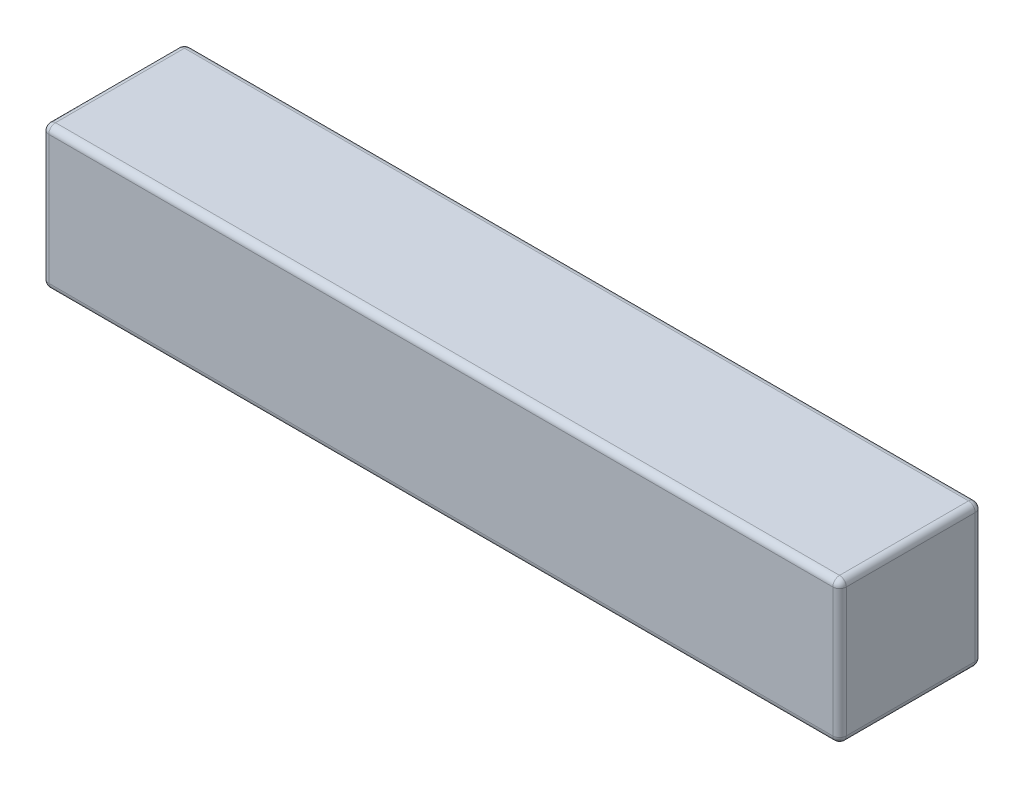
ISO-10303-21;
HEADER;
FILE_DESCRIPTION(('STEP AP214'),'2;1');
FILE_NAME('part.step','',(''),(''),'','','');
FILE_SCHEMA(('AUTOMOTIVE_DESIGN { 1 0 10303 214 1 1 1 1 }'));
ENDSEC;
DATA;
#1=APPLICATION_CONTEXT('core data for automotive mechanical design processes');
#2=APPLICATION_PROTOCOL_DEFINITION('international standard','automotive_design',2000,#1);
#3=PRODUCT_CONTEXT('',#1,'mechanical');
#4=PRODUCT('Part','Part','',(#3));
#5=PRODUCT_RELATED_PRODUCT_CATEGORY('part','',(#4));
#6=PRODUCT_DEFINITION_FORMATION('','',#4);
#7=PRODUCT_DEFINITION_CONTEXT('part definition',#1,'design');
#8=PRODUCT_DEFINITION('design','',#6,#7);
#9=PRODUCT_DEFINITION_SHAPE('','',#8);
#10=(LENGTH_UNIT() NAMED_UNIT(*) SI_UNIT(.MILLI.,.METRE.));
#11=(NAMED_UNIT(*) PLANE_ANGLE_UNIT() SI_UNIT($,.RADIAN.));
#12=(NAMED_UNIT(*) SI_UNIT($,.STERADIAN.) SOLID_ANGLE_UNIT());
#13=UNCERTAINTY_MEASURE_WITH_UNIT(LENGTH_MEASURE(1.E-05),#10,'distance_accuracy_value','');
#14=(GEOMETRIC_REPRESENTATION_CONTEXT(3) GLOBAL_UNCERTAINTY_ASSIGNED_CONTEXT((#13)) GLOBAL_UNIT_ASSIGNED_CONTEXT((#10,
#11,#12)) REPRESENTATION_CONTEXT('',''));
#15=CARTESIAN_POINT('',(0.,0.,0.));
#16=DIRECTION('',(0.,0.,1.));
#17=DIRECTION('',(1.,0.,0.));
#18=AXIS2_PLACEMENT_3D('',#15,#16,#17);
#19=CARTESIAN_POINT('',(13.85,-0.15,-0.379239631336402));
#20=DIRECTION('',(1.,0.,0.));
#21=DIRECTION('',(0.,0.,-1.));
#22=AXIS2_PLACEMENT_3D('',#19,#20,#21);
#23=SPHERICAL_SURFACE('',#22,0.15);
#24=CARTESIAN_POINT('',(13.85,-0.15,-0.379239631336402));
#25=DIRECTION('',(0.,1.,0.));
#26=DIRECTION('',(0.,0.,1.));
#27=AXIS2_PLACEMENT_3D('',#24,#25,#26);
#28=CIRCLE('',#27,0.15);
#29=CARTESIAN_POINT('',(14.,-0.15,-0.379239631336402));
#30=VERTEX_POINT('',#29);
#31=CARTESIAN_POINT('',(13.85,-0.15,-0.229239631336402));
#32=VERTEX_POINT('',#31);
#33=EDGE_CURVE('E293',#30,#32,#28,.F.);
#34=ORIENTED_EDGE('',*,*,#33,.F.);
#35=CARTESIAN_POINT('',(13.85,-0.15,-0.379239631336402));
#36=DIRECTION('',(0.,0.,-1.));
#37=DIRECTION('',(-1.,0.,0.));
#38=AXIS2_PLACEMENT_3D('',#35,#36,#37);
#39=CIRCLE('',#38,0.150000000000001);
#40=CARTESIAN_POINT('',(13.85,0.,-0.379239631336402));
#41=VERTEX_POINT('',#40);
#42=EDGE_CURVE('E114',#41,#30,#39,.T.);
#43=ORIENTED_EDGE('',*,*,#42,.F.);
#44=CARTESIAN_POINT('',(13.85,-0.15,-0.379239631336402));
#45=DIRECTION('',(1.,0.,0.));
#46=DIRECTION('',(0.,0.,-1.));
#47=AXIS2_PLACEMENT_3D('',#44,#45,#46);
#48=CIRCLE('',#47,0.15);
#49=EDGE_CURVE('E103',#32,#41,#48,.F.);
#50=ORIENTED_EDGE('',*,*,#49,.F.);
#51=EDGE_LOOP('',(#34,#43,#50));
#52=FACE_BOUND('',#51,.T.);
#53=ADVANCED_FACE('F16',(#52),#23,.T.);
#54=CARTESIAN_POINT('',(13.85,-0.15,-3.2542396313364));
#55=DIRECTION('',(1.,0.,0.));
#56=DIRECTION('',(0.,0.,-1.));
#57=AXIS2_PLACEMENT_3D('',#54,#55,#56);
#58=SPHERICAL_SURFACE('',#57,0.15);
#59=CARTESIAN_POINT('',(13.85,-0.15,-3.2542396313364));
#60=DIRECTION('',(0.,1.,0.));
#61=DIRECTION('',(0.,0.,1.));
#62=AXIS2_PLACEMENT_3D('',#59,#60,#61);
#63=CIRCLE('',#62,0.15);
#64=CARTESIAN_POINT('',(13.85,-0.15,-3.4042396313364));
#65=VERTEX_POINT('',#64);
#66=CARTESIAN_POINT('',(14.,-0.15,-3.2542396313364));
#67=VERTEX_POINT('',#66);
#68=EDGE_CURVE('E135',#65,#67,#63,.F.);
#69=ORIENTED_EDGE('',*,*,#68,.F.);
#70=CARTESIAN_POINT('',(13.85,-0.15,-3.2542396313364));
#71=DIRECTION('',(-1.,0.,0.));
#72=DIRECTION('',(0.,0.,1.));
#73=AXIS2_PLACEMENT_3D('',#70,#71,#72);
#74=CIRCLE('',#73,0.15);
#75=CARTESIAN_POINT('',(13.85,0.,-3.2542396313364));
#76=VERTEX_POINT('',#75);
#77=EDGE_CURVE('E288',#76,#65,#74,.T.);
#78=ORIENTED_EDGE('',*,*,#77,.F.);
#79=CARTESIAN_POINT('',(13.85,-0.15,-3.2542396313364));
#80=DIRECTION('',(0.,0.,-1.));
#81=DIRECTION('',(-1.,0.,0.));
#82=AXIS2_PLACEMENT_3D('',#79,#80,#81);
#83=CIRCLE('',#82,0.150000000000001);
#84=EDGE_CURVE('E284',#67,#76,#83,.F.);
#85=ORIENTED_EDGE('',*,*,#84,.F.);
#86=EDGE_LOOP('',(#69,#78,#85));
#87=FACE_BOUND('',#86,.T.);
#88=ADVANCED_FACE('F156',(#87),#58,.T.);
#89=CARTESIAN_POINT('',(-3.78,0.,-0.229239631336402));
#90=DIRECTION('',(0.,1.,0.));
#91=DIRECTION('',(0.,0.,1.));
#92=AXIS2_PLACEMENT_3D('',#89,#90,#91);
#93=PLANE('',#92);
#94=DIRECTION('',(0.,0.,1.));
#95=VECTOR('',#94,1.);
#96=CARTESIAN_POINT('',(-3.63,0.,-0.229239631336402));
#97=LINE('',#96,#95);
#98=CARTESIAN_POINT('',(-3.63,0.,-0.379239631336402));
#99=VERTEX_POINT('',#98);
#100=CARTESIAN_POINT('',(-3.63,0.,-3.2542396313364));
#101=VERTEX_POINT('',#100);
#102=EDGE_CURVE('E118',#99,#101,#97,.F.);
#103=ORIENTED_EDGE('',*,*,#102,.F.);
#104=DIRECTION('',(1.,0.,0.));
#105=VECTOR('',#104,1.);
#106=CARTESIAN_POINT('',(-3.78,0.,-0.379239631336402));
#107=LINE('',#106,#105);
#108=EDGE_CURVE('E106',#41,#99,#107,.F.);
#109=ORIENTED_EDGE('',*,*,#108,.F.);
#110=DIRECTION('',(0.,0.,-1.));
#111=VECTOR('',#110,1.);
#112=CARTESIAN_POINT('',(13.85,0.,-0.229239631336402));
#113=LINE('',#112,#111);
#114=EDGE_CURVE('E286',#76,#41,#113,.F.);
#115=ORIENTED_EDGE('',*,*,#114,.F.);
#116=DIRECTION('',(-1.,0.,0.));
#117=VECTOR('',#116,1.);
#118=CARTESIAN_POINT('',(-3.78,0.,-3.2542396313364));
#119=LINE('',#118,#117);
#120=EDGE_CURVE('E122',#101,#76,#119,.F.);
#121=ORIENTED_EDGE('',*,*,#120,.F.);
#122=EDGE_LOOP('',(#103,#109,#115,#121));
#123=FACE_BOUND('',#122,.T.);
#124=ADVANCED_FACE('F120',(#123),#93,.T.);
#125=CARTESIAN_POINT('',(-3.63,-0.15,-3.2542396313364));
#126=DIRECTION('',(1.,0.,0.));
#127=DIRECTION('',(0.,0.,-1.));
#128=AXIS2_PLACEMENT_3D('',#125,#126,#127);
#129=SPHERICAL_SURFACE('',#128,0.15);
#130=CARTESIAN_POINT('',(-3.63,-0.15,-3.2542396313364));
#131=DIRECTION('',(0.,0.,1.));
#132=DIRECTION('',(1.,0.,0.));
#133=AXIS2_PLACEMENT_3D('',#130,#131,#132);
#134=CIRCLE('',#133,0.15);
#135=CARTESIAN_POINT('',(-3.78,-0.15,-3.2542396313364));
#136=VERTEX_POINT('',#135);
#137=EDGE_CURVE('E124',#101,#136,#134,.T.);
#138=ORIENTED_EDGE('',*,*,#137,.F.);
#139=CARTESIAN_POINT('',(-3.63,-0.15,-3.2542396313364));
#140=DIRECTION('',(-1.,0.,0.));
#141=DIRECTION('',(0.,0.,1.));
#142=AXIS2_PLACEMENT_3D('',#139,#140,#141);
#143=CIRCLE('',#142,0.15);
#144=CARTESIAN_POINT('',(-3.63,-0.15,-3.4042396313364));
#145=VERTEX_POINT('',#144);
#146=EDGE_CURVE('E292',#145,#101,#143,.F.);
#147=ORIENTED_EDGE('',*,*,#146,.F.);
#148=CARTESIAN_POINT('',(-3.63,-0.15,-3.2542396313364));
#149=DIRECTION('',(0.,1.,0.));
#150=DIRECTION('',(0.,0.,1.));
#151=AXIS2_PLACEMENT_3D('',#148,#149,#150);
#152=CIRCLE('',#151,0.15);
#153=EDGE_CURVE('E365',#136,#145,#152,.F.);
#154=ORIENTED_EDGE('',*,*,#153,.F.);
#155=EDGE_LOOP('',(#138,#147,#154));
#156=FACE_BOUND('',#155,.T.);
#157=ADVANCED_FACE('F150',(#156),#129,.T.);
#158=CARTESIAN_POINT('',(-3.63,-0.15,-0.379239631336402));
#159=DIRECTION('',(1.,0.,0.));
#160=DIRECTION('',(0.,0.,-1.));
#161=AXIS2_PLACEMENT_3D('',#158,#159,#160);
#162=SPHERICAL_SURFACE('',#161,0.15);
#163=CARTESIAN_POINT('',(-3.63,-0.15,-0.379239631336402));
#164=DIRECTION('',(1.,0.,0.));
#165=DIRECTION('',(0.,0.,-1.));
#166=AXIS2_PLACEMENT_3D('',#163,#164,#165);
#167=CIRCLE('',#166,0.15);
#168=CARTESIAN_POINT('',(-3.63,-0.15,-0.229239631336402));
#169=VERTEX_POINT('',#168);
#170=EDGE_CURVE('E110',#99,#169,#167,.T.);
#171=ORIENTED_EDGE('',*,*,#170,.F.);
#172=CARTESIAN_POINT('',(-3.63,-0.15,-0.379239631336402));
#173=DIRECTION('',(0.,0.,1.));
#174=DIRECTION('',(1.,0.,0.));
#175=AXIS2_PLACEMENT_3D('',#172,#173,#174);
#176=CIRCLE('',#175,0.15);
#177=CARTESIAN_POINT('',(-3.78,-0.15,-0.379239631336402));
#178=VERTEX_POINT('',#177);
#179=EDGE_CURVE('E125',#178,#99,#176,.F.);
#180=ORIENTED_EDGE('',*,*,#179,.F.);
#181=CARTESIAN_POINT('',(-3.63,-0.15,-0.379239631336402));
#182=DIRECTION('',(0.,1.,0.));
#183=DIRECTION('',(0.,0.,1.));
#184=AXIS2_PLACEMENT_3D('',#181,#182,#183);
#185=CIRCLE('',#184,0.15);
#186=EDGE_CURVE('E138',#169,#178,#185,.F.);
#187=ORIENTED_EDGE('',*,*,#186,.F.);
#188=EDGE_LOOP('',(#171,#180,#187));
#189=FACE_BOUND('',#188,.T.);
#190=ADVANCED_FACE('F137',(#189),#162,.T.);
#191=CARTESIAN_POINT('',(-3.78,-0.15,-0.379239631336402));
#192=DIRECTION('',(1.,0.,0.));
#193=DIRECTION('',(0.,0.,-1.));
#194=AXIS2_PLACEMENT_3D('',#191,#192,#193);
#195=CYLINDRICAL_SURFACE('',#194,0.15);
#196=ORIENTED_EDGE('',*,*,#49,.T.);
#197=ORIENTED_EDGE('',*,*,#108,.T.);
#198=ORIENTED_EDGE('',*,*,#170,.T.);
#199=DIRECTION('',(1.,0.,0.));
#200=VECTOR('',#199,1.);
#201=CARTESIAN_POINT('',(-3.78,-0.15,-0.229239631336402));
#202=LINE('',#201,#200);
#203=EDGE_CURVE('E378',#32,#169,#202,.F.);
#204=ORIENTED_EDGE('',*,*,#203,.F.);
#205=EDGE_LOOP('',(#196,#197,#198,#204));
#206=FACE_BOUND('',#205,.T.);
#207=ADVANCED_FACE('F108',(#206),#195,.T.);
#208=CARTESIAN_POINT('',(13.85,-0.15,-0.229239631336402));
#209=DIRECTION('',(0.,0.,-1.));
#210=DIRECTION('',(-1.,0.,0.));
#211=AXIS2_PLACEMENT_3D('',#208,#209,#210);
#212=CYLINDRICAL_SURFACE('',#211,0.150000000000001);
#213=ORIENTED_EDGE('',*,*,#84,.T.);
#214=ORIENTED_EDGE('',*,*,#114,.T.);
#215=ORIENTED_EDGE('',*,*,#42,.T.);
#216=DIRECTION('',(0.,0.,-1.));
#217=VECTOR('',#216,1.);
#218=CARTESIAN_POINT('',(14.,-0.15,-0.229239631336402));
#219=LINE('',#218,#217);
#220=EDGE_CURVE('E236',#67,#30,#219,.F.);
#221=ORIENTED_EDGE('',*,*,#220,.F.);
#222=EDGE_LOOP('',(#213,#214,#215,#221));
#223=FACE_BOUND('',#222,.T.);
#224=ADVANCED_FACE('F274',(#223),#212,.T.);
#225=CARTESIAN_POINT('',(13.85,-3.175,-0.379239631336402));
#226=DIRECTION('',(0.,1.,0.));
#227=DIRECTION('',(0.,0.,1.));
#228=AXIS2_PLACEMENT_3D('',#225,#226,#227);
#229=CYLINDRICAL_SURFACE('',#228,0.15);
#230=ORIENTED_EDGE('',*,*,#33,.T.);
#231=DIRECTION('',(0.,1.,0.));
#232=VECTOR('',#231,1.);
#233=CARTESIAN_POINT('',(13.85,-3.175,-0.229239631336402));
#234=LINE('',#233,#232);
#235=CARTESIAN_POINT('',(13.85,-3.02499999999923,-0.229239631336402));
#236=VERTEX_POINT('',#235);
#237=EDGE_CURVE('E310',#236,#32,#234,.T.);
#238=ORIENTED_EDGE('',*,*,#237,.F.);
#239=CARTESIAN_POINT('',(13.85,-3.025,-0.379239631336402));
#240=DIRECTION('',(0.,-1.,2.04433251509177E-11));
#241=DIRECTION('',(1.,0.,0.));
#242=AXIS2_PLACEMENT_3D('',#239,#240,#241);
#243=CIRCLE('',#242,0.15);
#244=CARTESIAN_POINT('',(14.,-3.025,-0.379239631336402));
#245=VERTEX_POINT('',#244);
#246=EDGE_CURVE('E242',#245,#236,#243,.T.);
#247=ORIENTED_EDGE('',*,*,#246,.F.);
#248=DIRECTION('',(0.,1.,0.));
#249=VECTOR('',#248,1.);
#250=CARTESIAN_POINT('',(14.,-3.175,-0.379239631336402));
#251=LINE('',#250,#249);
#252=EDGE_CURVE('E234',#30,#245,#251,.F.);
#253=ORIENTED_EDGE('',*,*,#252,.F.);
#254=EDGE_LOOP('',(#230,#238,#247,#253));
#255=FACE_BOUND('',#254,.T.);
#256=ADVANCED_FACE('F271',(#255),#229,.T.);
#257=CARTESIAN_POINT('',(-3.78,-0.15,-3.2542396313364));
#258=DIRECTION('',(-1.,0.,0.));
#259=DIRECTION('',(0.,0.,1.));
#260=AXIS2_PLACEMENT_3D('',#257,#258,#259);
#261=CYLINDRICAL_SURFACE('',#260,0.15);
#262=ORIENTED_EDGE('',*,*,#146,.T.);
#263=ORIENTED_EDGE('',*,*,#120,.T.);
#264=ORIENTED_EDGE('',*,*,#77,.T.);
#265=DIRECTION('',(-1.,0.,0.));
#266=VECTOR('',#265,1.);
#267=CARTESIAN_POINT('',(14.,-0.15,-3.4042396313364));
#268=LINE('',#267,#266);
#269=EDGE_CURVE('E375',#145,#65,#268,.F.);
#270=ORIENTED_EDGE('',*,*,#269,.F.);
#271=EDGE_LOOP('',(#262,#263,#264,#270));
#272=FACE_BOUND('',#271,.T.);
#273=ADVANCED_FACE('F267',(#272),#261,.T.);
#274=CARTESIAN_POINT('',(13.85,-3.175,-3.2542396313364));
#275=DIRECTION('',(0.,1.,0.));
#276=DIRECTION('',(0.,0.,1.));
#277=AXIS2_PLACEMENT_3D('',#274,#275,#276);
#278=CYLINDRICAL_SURFACE('',#277,0.15);
#279=ORIENTED_EDGE('',*,*,#68,.T.);
#280=DIRECTION('',(0.,1.,0.));
#281=VECTOR('',#280,1.);
#282=CARTESIAN_POINT('',(14.,-3.175,-3.2542396313364));
#283=LINE('',#282,#281);
#284=CARTESIAN_POINT('',(14.,-3.025,-3.2542396313364));
#285=VERTEX_POINT('',#284);
#286=EDGE_CURVE('E239',#285,#67,#283,.T.);
#287=ORIENTED_EDGE('',*,*,#286,.F.);
#288=CARTESIAN_POINT('',(13.85,-3.025,-3.2542396313364));
#289=DIRECTION('',(0.,1.,0.));
#290=DIRECTION('',(1.,0.,0.));
#291=AXIS2_PLACEMENT_3D('',#288,#289,#290);
#292=CIRCLE('',#291,0.15);
#293=CARTESIAN_POINT('',(13.85,-3.025,-3.4042396313364));
#294=VERTEX_POINT('',#293);
#295=EDGE_CURVE('E232',#294,#285,#292,.F.);
#296=ORIENTED_EDGE('',*,*,#295,.F.);
#297=DIRECTION('',(0.,1.,0.));
#298=VECTOR('',#297,1.);
#299=CARTESIAN_POINT('',(13.85,-3.175,-3.4042396313364));
#300=LINE('',#299,#298);
#301=EDGE_CURVE('E374',#65,#294,#300,.F.);
#302=ORIENTED_EDGE('',*,*,#301,.F.);
#303=EDGE_LOOP('',(#279,#287,#296,#302));
#304=FACE_BOUND('',#303,.T.);
#305=ADVANCED_FACE('F264',(#304),#278,.T.);
#306=CARTESIAN_POINT('',(-3.63,-0.15,-0.229239631336402));
#307=DIRECTION('',(0.,0.,1.));
#308=DIRECTION('',(1.,0.,0.));
#309=AXIS2_PLACEMENT_3D('',#306,#307,#308);
#310=CYLINDRICAL_SURFACE('',#309,0.15);
#311=ORIENTED_EDGE('',*,*,#137,.T.);
#312=DIRECTION('',(0.,0.,1.));
#313=VECTOR('',#312,1.);
#314=CARTESIAN_POINT('',(-3.78,-0.15,-3.4042396313364));
#315=LINE('',#314,#313);
#316=EDGE_CURVE('E131',#178,#136,#315,.F.);
#317=ORIENTED_EDGE('',*,*,#316,.F.);
#318=ORIENTED_EDGE('',*,*,#179,.T.);
#319=ORIENTED_EDGE('',*,*,#102,.T.);
#320=EDGE_LOOP('',(#311,#317,#318,#319));
#321=FACE_BOUND('',#320,.T.);
#322=ADVANCED_FACE('F129',(#321),#310,.T.);
#323=CARTESIAN_POINT('',(-3.63,-3.175,-3.2542396313364));
#324=DIRECTION('',(0.,1.,0.));
#325=DIRECTION('',(0.,0.,1.));
#326=AXIS2_PLACEMENT_3D('',#323,#324,#325);
#327=CYLINDRICAL_SURFACE('',#326,0.15);
#328=ORIENTED_EDGE('',*,*,#153,.T.);
#329=DIRECTION('',(0.,1.,0.));
#330=VECTOR('',#329,1.);
#331=CARTESIAN_POINT('',(-3.63,-3.175,-3.4042396313364));
#332=LINE('',#331,#330);
#333=CARTESIAN_POINT('',(-3.63,-3.025,-3.4042396313364));
#334=VERTEX_POINT('',#333);
#335=EDGE_CURVE('E230',#334,#145,#332,.T.);
#336=ORIENTED_EDGE('',*,*,#335,.F.);
#337=CARTESIAN_POINT('',(-3.63,-3.025,-3.2542396313364));
#338=DIRECTION('',(0.,1.,0.));
#339=DIRECTION('',(0.,0.,1.));
#340=AXIS2_PLACEMENT_3D('',#337,#338,#339);
#341=CIRCLE('',#340,0.15);
#342=CARTESIAN_POINT('',(-3.78,-3.025,-3.2542396313364));
#343=VERTEX_POINT('',#342);
#344=EDGE_CURVE('E367',#334,#343,#341,.T.);
#345=ORIENTED_EDGE('',*,*,#344,.T.);
#346=DIRECTION('',(0.,1.,0.));
#347=VECTOR('',#346,1.);
#348=CARTESIAN_POINT('',(-3.78,-3.175,-3.2542396313364));
#349=LINE('',#348,#347);
#350=EDGE_CURVE('E204',#136,#343,#349,.F.);
#351=ORIENTED_EDGE('',*,*,#350,.F.);
#352=EDGE_LOOP('',(#328,#336,#345,#351));
#353=FACE_BOUND('',#352,.T.);
#354=ADVANCED_FACE('F257',(#353),#327,.T.);
#355=CARTESIAN_POINT('',(-3.63,-3.175,-0.379239631336402));
#356=DIRECTION('',(0.,1.,0.));
#357=DIRECTION('',(0.,0.,1.));
#358=AXIS2_PLACEMENT_3D('',#355,#356,#357);
#359=CYLINDRICAL_SURFACE('',#358,0.15);
#360=ORIENTED_EDGE('',*,*,#186,.T.);
#361=DIRECTION('',(0.,1.,0.));
#362=VECTOR('',#361,1.);
#363=CARTESIAN_POINT('',(-3.78,-3.175,-0.379239631336402));
#364=LINE('',#363,#362);
#365=CARTESIAN_POINT('',(-3.78,-3.025,-0.379239631336402));
#366=VERTEX_POINT('',#365);
#367=EDGE_CURVE('E202',#366,#178,#364,.T.);
#368=ORIENTED_EDGE('',*,*,#367,.F.);
#369=CARTESIAN_POINT('',(-3.63,-3.025,-0.379239631336402));
#370=DIRECTION('',(0.,-1.,0.));
#371=DIRECTION('',(1.,0.,0.));
#372=AXIS2_PLACEMENT_3D('',#369,#370,#371);
#373=CIRCLE('',#372,0.15);
#374=CARTESIAN_POINT('',(-3.63,-3.025,-0.229239631336402));
#375=VERTEX_POINT('',#374);
#376=EDGE_CURVE('E208',#375,#366,#373,.T.);
#377=ORIENTED_EDGE('',*,*,#376,.F.);
#378=DIRECTION('',(0.,1.,0.));
#379=VECTOR('',#378,1.);
#380=CARTESIAN_POINT('',(-3.63,-3.175,-0.229239631336402));
#381=LINE('',#380,#379);
#382=EDGE_CURVE('E315',#169,#375,#381,.F.);
#383=ORIENTED_EDGE('',*,*,#382,.F.);
#384=EDGE_LOOP('',(#360,#368,#377,#383));
#385=FACE_BOUND('',#384,.T.);
#386=ADVANCED_FACE('F253',(#385),#359,.T.);
#387=CARTESIAN_POINT('',(-3.78,-3.175,-0.229239631336402));
#388=DIRECTION('',(0.,0.,1.));
#389=DIRECTION('',(1.,0.,0.));
#390=AXIS2_PLACEMENT_3D('',#387,#388,#389);
#391=PLANE('',#390);
#392=ORIENTED_EDGE('',*,*,#382,.T.);
#393=DIRECTION('',(-1.,0.,0.));
#394=VECTOR('',#393,1.);
#395=CARTESIAN_POINT('',(-3.78,-3.025,-0.229239631336402));
#396=LINE('',#395,#394);
#397=EDGE_CURVE('E328',#236,#375,#396,.T.);
#398=ORIENTED_EDGE('',*,*,#397,.F.);
#399=ORIENTED_EDGE('',*,*,#237,.T.);
#400=ORIENTED_EDGE('',*,*,#203,.T.);
#401=EDGE_LOOP('',(#392,#398,#399,#400));
#402=FACE_BOUND('',#401,.T.);
#403=ADVANCED_FACE('F249',(#402),#391,.T.);
#404=CARTESIAN_POINT('',(13.85,-3.025,-0.379239631336402));
#405=DIRECTION('',(1.,0.,0.));
#406=DIRECTION('',(0.,0.,-1.));
#407=AXIS2_PLACEMENT_3D('',#404,#405,#406);
#408=SPHERICAL_SURFACE('',#407,0.15);
#409=CARTESIAN_POINT('',(13.85,-3.025,-0.379239631336402));
#410=DIRECTION('',(-1.,0.,0.));
#411=DIRECTION('',(0.,0.,1.));
#412=AXIS2_PLACEMENT_3D('',#409,#410,#411);
#413=CIRCLE('',#412,0.15);
#414=CARTESIAN_POINT('',(13.85,-3.175,-0.379239631336402));
#415=VERTEX_POINT('',#414);
#416=EDGE_CURVE('E200',#415,#236,#413,.T.);
#417=ORIENTED_EDGE('',*,*,#416,.F.);
#418=CARTESIAN_POINT('',(13.85,-3.025,-0.379239631336402));
#419=DIRECTION('',(0.,0.,1.));
#420=DIRECTION('',(1.,0.,0.));
#421=AXIS2_PLACEMENT_3D('',#418,#419,#420);
#422=CIRCLE('',#421,0.150000000000001);
#423=EDGE_CURVE('E319',#245,#415,#422,.F.);
#424=ORIENTED_EDGE('',*,*,#423,.F.);
#425=ORIENTED_EDGE('',*,*,#246,.T.);
#426=EDGE_LOOP('',(#417,#424,#425));
#427=FACE_BOUND('',#426,.T.);
#428=ADVANCED_FACE('F246',(#427),#408,.T.);
#429=CARTESIAN_POINT('',(14.,-3.175,-0.229239631336402));
#430=DIRECTION('',(1.,0.,0.));
#431=DIRECTION('',(0.,0.,-1.));
#432=AXIS2_PLACEMENT_3D('',#429,#430,#431);
#433=PLANE('',#432);
#434=ORIENTED_EDGE('',*,*,#220,.T.);
#435=ORIENTED_EDGE('',*,*,#252,.T.);
#436=DIRECTION('',(0.,0.,1.));
#437=VECTOR('',#436,1.);
#438=CARTESIAN_POINT('',(14.,-3.025,-0.229239631336402));
#439=LINE('',#438,#437);
#440=EDGE_CURVE('E317',#285,#245,#439,.T.);
#441=ORIENTED_EDGE('',*,*,#440,.F.);
#442=ORIENTED_EDGE('',*,*,#286,.T.);
#443=EDGE_LOOP('',(#434,#435,#441,#442));
#444=FACE_BOUND('',#443,.T.);
#445=ADVANCED_FACE('F224',(#444),#433,.T.);
#446=CARTESIAN_POINT('',(13.85,-3.025,-3.2542396313364));
#447=DIRECTION('',(1.,0.,0.));
#448=DIRECTION('',(0.,0.,-1.));
#449=AXIS2_PLACEMENT_3D('',#446,#447,#448);
#450=SPHERICAL_SURFACE('',#449,0.15);
#451=CARTESIAN_POINT('',(13.85,-3.025,-3.2542396313364));
#452=DIRECTION('',(1.,0.,0.));
#453=DIRECTION('',(0.,0.,-1.));
#454=AXIS2_PLACEMENT_3D('',#451,#452,#453);
#455=CIRCLE('',#454,0.15);
#456=CARTESIAN_POINT('',(13.85,-3.175,-3.25423963133334));
#457=VERTEX_POINT('',#456);
#458=EDGE_CURVE('E322',#294,#457,#455,.F.);
#459=ORIENTED_EDGE('',*,*,#458,.F.);
#460=ORIENTED_EDGE('',*,*,#295,.T.);
#461=CARTESIAN_POINT('',(13.85,-3.025,-3.2542396313364));
#462=DIRECTION('',(0.,0.,1.));
#463=DIRECTION('',(1.,0.,0.));
#464=AXIS2_PLACEMENT_3D('',#461,#462,#463);
#465=CIRCLE('',#464,0.150000000000001);
#466=EDGE_CURVE('E321',#457,#285,#465,.T.);
#467=ORIENTED_EDGE('',*,*,#466,.F.);
#468=EDGE_LOOP('',(#459,#460,#467));
#469=FACE_BOUND('',#468,.T.);
#470=ADVANCED_FACE('F219',(#469),#450,.T.);
#471=CARTESIAN_POINT('',(14.,-3.175,-3.4042396313364));
#472=DIRECTION('',(0.,0.,-1.));
#473=DIRECTION('',(-1.,0.,0.));
#474=AXIS2_PLACEMENT_3D('',#471,#472,#473);
#475=PLANE('',#474);
#476=ORIENTED_EDGE('',*,*,#301,.T.);
#477=DIRECTION('',(1.,0.,0.));
#478=VECTOR('',#477,1.);
#479=CARTESIAN_POINT('',(14.,-3.025,-3.4042396313364));
#480=LINE('',#479,#478);
#481=EDGE_CURVE('E349',#334,#294,#480,.T.);
#482=ORIENTED_EDGE('',*,*,#481,.F.);
#483=ORIENTED_EDGE('',*,*,#335,.T.);
#484=ORIENTED_EDGE('',*,*,#269,.T.);
#485=EDGE_LOOP('',(#476,#482,#483,#484));
#486=FACE_BOUND('',#485,.T.);
#487=ADVANCED_FACE('F215',(#486),#475,.T.);
#488=CARTESIAN_POINT('',(-3.63,-3.025,-0.379239631336402));
#489=DIRECTION('',(1.,0.,0.));
#490=DIRECTION('',(0.,0.,-1.));
#491=AXIS2_PLACEMENT_3D('',#488,#489,#490);
#492=SPHERICAL_SURFACE('',#491,0.15);
#493=CARTESIAN_POINT('',(-3.63,-3.025,-0.379239631336402));
#494=DIRECTION('',(-1.,0.,0.));
#495=DIRECTION('',(0.,0.,1.));
#496=AXIS2_PLACEMENT_3D('',#493,#494,#495);
#497=CIRCLE('',#496,0.15);
#498=CARTESIAN_POINT('',(-3.63,-3.175,-0.37923963133621));
#499=VERTEX_POINT('',#498);
#500=EDGE_CURVE('E325',#375,#499,#497,.F.);
#501=ORIENTED_EDGE('',*,*,#500,.F.);
#502=ORIENTED_EDGE('',*,*,#376,.T.);
#503=CARTESIAN_POINT('',(-3.63,-3.025,-0.379239631336402));
#504=DIRECTION('',(0.,0.,-1.));
#505=DIRECTION('',(-1.,0.,0.));
#506=AXIS2_PLACEMENT_3D('',#503,#504,#505);
#507=CIRCLE('',#506,0.15);
#508=EDGE_CURVE('E346',#499,#366,#507,.T.);
#509=ORIENTED_EDGE('',*,*,#508,.F.);
#510=EDGE_LOOP('',(#501,#502,#509));
#511=FACE_BOUND('',#510,.T.);
#512=ADVANCED_FACE('F212',(#511),#492,.T.);
#513=CARTESIAN_POINT('',(-3.78,-3.175,-3.4042396313364));
#514=DIRECTION('',(-1.,0.,0.));
#515=DIRECTION('',(0.,0.,1.));
#516=AXIS2_PLACEMENT_3D('',#513,#514,#515);
#517=PLANE('',#516);
#518=DIRECTION('',(0.,0.,-1.));
#519=VECTOR('',#518,1.);
#520=CARTESIAN_POINT('',(-3.78,-3.025,-3.4042396313364));
#521=LINE('',#520,#519);
#522=EDGE_CURVE('E341',#366,#343,#521,.T.);
#523=ORIENTED_EDGE('',*,*,#522,.F.);
#524=ORIENTED_EDGE('',*,*,#367,.T.);
#525=ORIENTED_EDGE('',*,*,#316,.T.);
#526=ORIENTED_EDGE('',*,*,#350,.T.);
#527=EDGE_LOOP('',(#523,#524,#525,#526));
#528=FACE_BOUND('',#527,.T.);
#529=ADVANCED_FACE('F194',(#528),#517,.T.);
#530=CARTESIAN_POINT('',(-3.63,-3.025,-3.2542396313364));
#531=DIRECTION('',(1.,0.,0.));
#532=DIRECTION('',(0.,0.,-1.));
#533=AXIS2_PLACEMENT_3D('',#530,#531,#532);
#534=SPHERICAL_SURFACE('',#533,0.15);
#535=CARTESIAN_POINT('',(-3.63,-3.025,-3.2542396313364));
#536=DIRECTION('',(0.,0.,-1.));
#537=DIRECTION('',(-1.,0.,0.));
#538=AXIS2_PLACEMENT_3D('',#535,#536,#537);
#539=CIRCLE('',#538,0.15);
#540=CARTESIAN_POINT('',(-3.63,-3.175,-3.2542396313364));
#541=VERTEX_POINT('',#540);
#542=EDGE_CURVE('E33',#343,#541,#539,.F.);
#543=ORIENTED_EDGE('',*,*,#542,.F.);
#544=ORIENTED_EDGE('',*,*,#344,.F.);
#545=CARTESIAN_POINT('',(-3.63,-3.025,-3.2542396313364));
#546=DIRECTION('',(1.,0.,0.));
#547=DIRECTION('',(0.,0.,-1.));
#548=AXIS2_PLACEMENT_3D('',#545,#546,#547);
#549=CIRCLE('',#548,0.15);
#550=EDGE_CURVE('E352',#541,#334,#549,.T.);
#551=ORIENTED_EDGE('',*,*,#550,.F.);
#552=EDGE_LOOP('',(#543,#544,#551));
#553=FACE_BOUND('',#552,.T.);
#554=ADVANCED_FACE('F189',(#553),#534,.T.);
#555=CARTESIAN_POINT('',(-3.78,-3.025,-0.379239631336402));
#556=DIRECTION('',(-1.,0.,0.));
#557=DIRECTION('',(0.,0.,1.));
#558=AXIS2_PLACEMENT_3D('',#555,#556,#557);
#559=CYLINDRICAL_SURFACE('',#558,0.15);
#560=ORIENTED_EDGE('',*,*,#500,.T.);
#561=DIRECTION('',(1.,0.,0.));
#562=VECTOR('',#561,1.);
#563=CARTESIAN_POINT('',(-3.78,-3.175,-0.379239631336402));
#564=LINE('',#563,#562);
#565=EDGE_CURVE('E334',#499,#415,#564,.T.);
#566=ORIENTED_EDGE('',*,*,#565,.T.);
#567=ORIENTED_EDGE('',*,*,#416,.T.);
#568=ORIENTED_EDGE('',*,*,#397,.T.);
#569=EDGE_LOOP('',(#560,#566,#567,#568));
#570=FACE_BOUND('',#569,.T.);
#571=ADVANCED_FACE('F185',(#570),#559,.T.);
#572=CARTESIAN_POINT('',(13.85,-3.025,-0.229239631336402));
#573=DIRECTION('',(0.,0.,1.));
#574=DIRECTION('',(1.,0.,0.));
#575=AXIS2_PLACEMENT_3D('',#572,#573,#574);
#576=CYLINDRICAL_SURFACE('',#575,0.150000000000001);
#577=ORIENTED_EDGE('',*,*,#466,.T.);
#578=ORIENTED_EDGE('',*,*,#440,.T.);
#579=ORIENTED_EDGE('',*,*,#423,.T.);
#580=DIRECTION('',(0.,0.,1.));
#581=VECTOR('',#580,1.);
#582=CARTESIAN_POINT('',(13.85,-3.175,-0.229239631336402));
#583=LINE('',#582,#581);
#584=EDGE_CURVE('E338',#415,#457,#583,.F.);
#585=ORIENTED_EDGE('',*,*,#584,.T.);
#586=EDGE_LOOP('',(#577,#578,#579,#585));
#587=FACE_BOUND('',#586,.T.);
#588=ADVANCED_FACE('F181',(#587),#576,.T.);
#589=CARTESIAN_POINT('',(14.,-3.025,-3.2542396313364));
#590=DIRECTION('',(1.,0.,0.));
#591=DIRECTION('',(0.,0.,-1.));
#592=AXIS2_PLACEMENT_3D('',#589,#590,#591);
#593=CYLINDRICAL_SURFACE('',#592,0.15);
#594=ORIENTED_EDGE('',*,*,#550,.T.);
#595=ORIENTED_EDGE('',*,*,#481,.T.);
#596=ORIENTED_EDGE('',*,*,#458,.T.);
#597=DIRECTION('',(1.,0.,0.));
#598=VECTOR('',#597,1.);
#599=CARTESIAN_POINT('',(-3.78,-3.175,-3.2542396313364));
#600=LINE('',#599,#598);
#601=EDGE_CURVE('E25',#457,#541,#600,.F.);
#602=ORIENTED_EDGE('',*,*,#601,.T.);
#603=EDGE_LOOP('',(#594,#595,#596,#602));
#604=FACE_BOUND('',#603,.T.);
#605=ADVANCED_FACE('F175',(#604),#593,.T.);
#606=CARTESIAN_POINT('',(-3.63,-3.025,-3.4042396313364));
#607=DIRECTION('',(0.,0.,-1.));
#608=DIRECTION('',(-1.,0.,0.));
#609=AXIS2_PLACEMENT_3D('',#606,#607,#608);
#610=CYLINDRICAL_SURFACE('',#609,0.15);
#611=ORIENTED_EDGE('',*,*,#542,.T.);
#612=DIRECTION('',(0.,0.,1.));
#613=VECTOR('',#612,1.);
#614=CARTESIAN_POINT('',(-3.63,-3.175,-0.229239631336402));
#615=LINE('',#614,#613);
#616=EDGE_CURVE('E11',#541,#499,#615,.T.);
#617=ORIENTED_EDGE('',*,*,#616,.T.);
#618=ORIENTED_EDGE('',*,*,#508,.T.);
#619=ORIENTED_EDGE('',*,*,#522,.T.);
#620=EDGE_LOOP('',(#611,#617,#618,#619));
#621=FACE_BOUND('',#620,.T.);
#622=ADVANCED_FACE('F169',(#621),#610,.T.);
#623=CARTESIAN_POINT('',(-3.78,-3.175,-0.229239631336402));
#624=DIRECTION('',(0.,1.,0.));
#625=DIRECTION('',(0.,0.,1.));
#626=AXIS2_PLACEMENT_3D('',#623,#624,#625);
#627=PLANE('',#626);
#628=ORIENTED_EDGE('',*,*,#601,.F.);
#629=ORIENTED_EDGE('',*,*,#584,.F.);
#630=ORIENTED_EDGE('',*,*,#565,.F.);
#631=ORIENTED_EDGE('',*,*,#616,.F.);
#632=EDGE_LOOP('',(#628,#629,#630,#631));
#633=FACE_BOUND('',#632,.T.);
#634=ADVANCED_FACE('F167',(#633),#627,.F.);
#635=CLOSED_SHELL('',(#53,#88,#124,#157,#190,#207,#224,#256,#273,#305,#322,#354,#386,#403,#428,
#445,#470,#487,#512,#529,#554,#571,#588,#605,#622,#634));
#636=MANIFOLD_SOLID_BREP('B1',#635);
#637=ADVANCED_BREP_SHAPE_REPRESENTATION('',(#18,#636),#14);
#638=SHAPE_DEFINITION_REPRESENTATION(#9,#637);
ENDSEC;
END-ISO-10303-21;
